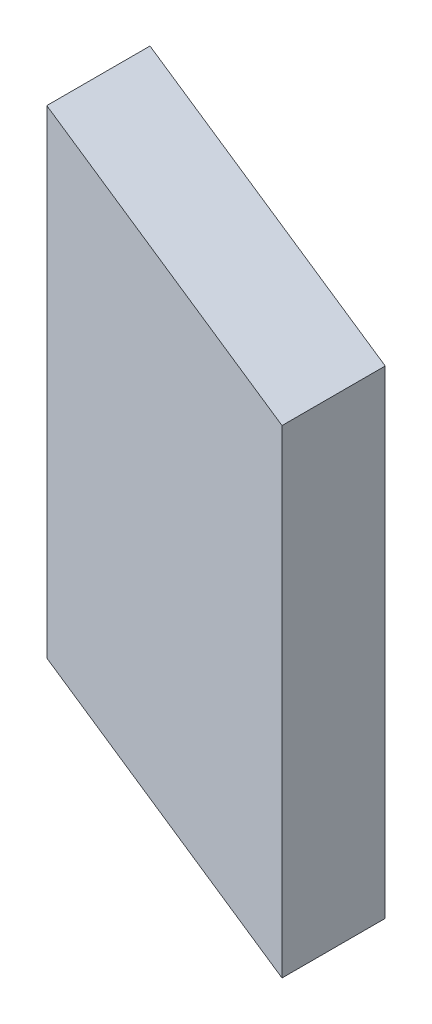
ISO-10303-21;
HEADER;
FILE_DESCRIPTION(('STEP AP214'),'2;1');
FILE_NAME('part.step','',(''),(''),'','','');
FILE_SCHEMA(('AUTOMOTIVE_DESIGN { 1 0 10303 214 1 1 1 1 }'));
ENDSEC;
DATA;
#1=APPLICATION_CONTEXT('core data for automotive mechanical design processes');
#2=APPLICATION_PROTOCOL_DEFINITION('international standard','automotive_design',2000,#1);
#3=PRODUCT_CONTEXT('',#1,'mechanical');
#4=PRODUCT('Part','Part','',(#3));
#5=PRODUCT_RELATED_PRODUCT_CATEGORY('part','',(#4));
#6=PRODUCT_DEFINITION_FORMATION('','',#4);
#7=PRODUCT_DEFINITION_CONTEXT('part definition',#1,'design');
#8=PRODUCT_DEFINITION('design','',#6,#7);
#9=PRODUCT_DEFINITION_SHAPE('','',#8);
#10=(LENGTH_UNIT() NAMED_UNIT(*) SI_UNIT(.MILLI.,.METRE.));
#11=(NAMED_UNIT(*) PLANE_ANGLE_UNIT() SI_UNIT($,.RADIAN.));
#12=(NAMED_UNIT(*) SI_UNIT($,.STERADIAN.) SOLID_ANGLE_UNIT());
#13=UNCERTAINTY_MEASURE_WITH_UNIT(LENGTH_MEASURE(1.E-05),#10,'distance_accuracy_value','');
#14=(GEOMETRIC_REPRESENTATION_CONTEXT(3) GLOBAL_UNCERTAINTY_ASSIGNED_CONTEXT((#13)) GLOBAL_UNIT_ASSIGNED_CONTEXT((#10,
#11,#12)) REPRESENTATION_CONTEXT('',''));
#15=CARTESIAN_POINT('',(0.,0.,0.));
#16=DIRECTION('',(0.,0.,1.));
#17=DIRECTION('',(1.,0.,0.));
#18=AXIS2_PLACEMENT_3D('',#15,#16,#17);
#19=CARTESIAN_POINT('',(0.,40.,-35.));
#20=DIRECTION('',(-0.374606593415916,0.,0.927183854566786));
#21=DIRECTION('',(0.927183854566786,0.,0.374606593415916));
#22=AXIS2_PLACEMENT_3D('',#19,#20,#21);
#23=PLANE('',#22);
#24=DIRECTION('',(-0.927183854566786,0.,-0.374606593415916));
#25=VECTOR('',#24,1.);
#26=CARTESIAN_POINT('',(0.,0.,-35.));
#27=LINE('',#26,#25);
#28=CARTESIAN_POINT('',(33.,0.,-21.6671345474397));
#29=VERTEX_POINT('',#28);
#30=CARTESIAN_POINT('',(0.,0.,-35.));
#31=VERTEX_POINT('',#30);
#32=EDGE_CURVE('E95',#29,#31,#27,.T.);
#33=ORIENTED_EDGE('',*,*,#32,.T.);
#34=DIRECTION('',(0.,-1.,0.));
#35=VECTOR('',#34,1.);
#36=CARTESIAN_POINT('',(0.,40.,-35.));
#37=LINE('',#36,#35);
#38=CARTESIAN_POINT('',(0.,40.,-35.));
#39=VERTEX_POINT('',#38);
#40=EDGE_CURVE('E11',#39,#31,#37,.T.);
#41=ORIENTED_EDGE('',*,*,#40,.F.);
#42=DIRECTION('',(-0.927183854566786,0.,-0.374606593415916));
#43=VECTOR('',#42,1.);
#44=CARTESIAN_POINT('',(0.,40.,-35.));
#45=LINE('',#44,#43);
#46=CARTESIAN_POINT('',(33.,40.,-21.6671345474397));
#47=VERTEX_POINT('',#46);
#48=EDGE_CURVE('E83',#47,#39,#45,.T.);
#49=ORIENTED_EDGE('',*,*,#48,.F.);
#50=DIRECTION('',(0.,-1.,0.));
#51=VECTOR('',#50,1.);
#52=CARTESIAN_POINT('',(33.,40.,-21.6671345474397));
#53=LINE('',#52,#51);
#54=EDGE_CURVE('E91',#47,#29,#53,.T.);
#55=ORIENTED_EDGE('',*,*,#54,.T.);
#56=EDGE_LOOP('',(#33,#41,#49,#55));
#57=FACE_BOUND('',#56,.T.);
#58=ADVANCED_FACE('F32',(#57),#23,.F.);
#59=CARTESIAN_POINT('',(0.,40.,-26.3717220585793));
#60=DIRECTION('',(1.,0.,0.));
#61=DIRECTION('',(0.,0.,-1.));
#62=AXIS2_PLACEMENT_3D('',#59,#60,#61);
#63=PLANE('',#62);
#64=DIRECTION('',(0.,0.,1.));
#65=VECTOR('',#64,1.);
#66=CARTESIAN_POINT('',(0.,0.,-26.3717220585793));
#67=LINE('',#66,#65);
#68=CARTESIAN_POINT('',(0.,0.,-26.3717220585793));
#69=VERTEX_POINT('',#68);
#70=EDGE_CURVE('E87',#31,#69,#67,.T.);
#71=ORIENTED_EDGE('',*,*,#70,.T.);
#72=DIRECTION('',(0.,-1.,0.));
#73=VECTOR('',#72,1.);
#74=CARTESIAN_POINT('',(0.,40.,-26.3717220585793));
#75=LINE('',#74,#73);
#76=CARTESIAN_POINT('',(0.,40.,-26.3717220585793));
#77=VERTEX_POINT('',#76);
#78=EDGE_CURVE('E40',#77,#69,#75,.T.);
#79=ORIENTED_EDGE('',*,*,#78,.F.);
#80=DIRECTION('',(0.,0.,1.));
#81=VECTOR('',#80,1.);
#82=CARTESIAN_POINT('',(0.,40.,-26.3717220585793));
#83=LINE('',#82,#81);
#84=EDGE_CURVE('E78',#39,#77,#83,.T.);
#85=ORIENTED_EDGE('',*,*,#84,.F.);
#86=ORIENTED_EDGE('',*,*,#40,.T.);
#87=EDGE_LOOP('',(#71,#79,#85,#86));
#88=FACE_BOUND('',#87,.T.);
#89=ADVANCED_FACE('F86',(#88),#63,.F.);
#90=CARTESIAN_POINT('',(0.,40.,-26.3717220585793));
#91=DIRECTION('',(0.374606593415916,0.,-0.927183854566786));
#92=DIRECTION('',(-0.927183854566786,0.,-0.374606593415916));
#93=AXIS2_PLACEMENT_3D('',#90,#91,#92);
#94=PLANE('',#93);
#95=DIRECTION('',(0.927183854566786,0.,0.374606593415916));
#96=VECTOR('',#95,1.);
#97=CARTESIAN_POINT('',(0.,0.,-26.3717220585793));
#98=LINE('',#97,#96);
#99=CARTESIAN_POINT('',(33.,0.,-13.038856606019));
#100=VERTEX_POINT('',#99);
#101=EDGE_CURVE('E65',#69,#100,#98,.T.);
#102=ORIENTED_EDGE('',*,*,#101,.T.);
#103=DIRECTION('',(0.,-1.,0.));
#104=VECTOR('',#103,1.);
#105=CARTESIAN_POINT('',(33.,40.,-13.038856606019));
#106=LINE('',#105,#104);
#107=CARTESIAN_POINT('',(33.,40.,-13.038856606019));
#108=VERTEX_POINT('',#107);
#109=EDGE_CURVE('E88',#108,#100,#106,.T.);
#110=ORIENTED_EDGE('',*,*,#109,.F.);
#111=DIRECTION('',(0.927183854566786,0.,0.374606593415916));
#112=VECTOR('',#111,1.);
#113=CARTESIAN_POINT('',(0.,40.,-26.3717220585793));
#114=LINE('',#113,#112);
#115=EDGE_CURVE('E81',#77,#108,#114,.T.);
#116=ORIENTED_EDGE('',*,*,#115,.F.);
#117=ORIENTED_EDGE('',*,*,#78,.T.);
#118=EDGE_LOOP('',(#102,#110,#116,#117));
#119=FACE_BOUND('',#118,.T.);
#120=ADVANCED_FACE('F89',(#119),#94,.F.);
#121=CARTESIAN_POINT('',(33.,40.,-21.6671345474397));
#122=DIRECTION('',(-1.,0.,0.));
#123=DIRECTION('',(0.,0.,1.));
#124=AXIS2_PLACEMENT_3D('',#121,#122,#123);
#125=PLANE('',#124);
#126=DIRECTION('',(0.,0.,-1.));
#127=VECTOR('',#126,1.);
#128=CARTESIAN_POINT('',(33.,0.,-21.6671345474397));
#129=LINE('',#128,#127);
#130=EDGE_CURVE('E71',#100,#29,#129,.T.);
#131=ORIENTED_EDGE('',*,*,#130,.T.);
#132=ORIENTED_EDGE('',*,*,#54,.F.);
#133=DIRECTION('',(0.,0.,-1.));
#134=VECTOR('',#133,1.);
#135=CARTESIAN_POINT('',(33.,40.,-21.6671345474397));
#136=LINE('',#135,#134);
#137=EDGE_CURVE('E48',#108,#47,#136,.T.);
#138=ORIENTED_EDGE('',*,*,#137,.F.);
#139=ORIENTED_EDGE('',*,*,#109,.T.);
#140=EDGE_LOOP('',(#131,#132,#138,#139));
#141=FACE_BOUND('',#140,.T.);
#142=ADVANCED_FACE('F102',(#141),#125,.F.);
#143=CARTESIAN_POINT('',(0.,40.,0.));
#144=DIRECTION('',(0.,-1.,0.));
#145=DIRECTION('',(0.,0.,-1.));
#146=AXIS2_PLACEMENT_3D('',#143,#144,#145);
#147=PLANE('',#146);
#148=ORIENTED_EDGE('',*,*,#48,.T.);
#149=ORIENTED_EDGE('',*,*,#84,.T.);
#150=ORIENTED_EDGE('',*,*,#115,.T.);
#151=ORIENTED_EDGE('',*,*,#137,.T.);
#152=EDGE_LOOP('',(#148,#149,#150,#151));
#153=FACE_BOUND('',#152,.T.);
#154=ADVANCED_FACE('F79',(#153),#147,.F.);
#155=CARTESIAN_POINT('',(0.,0.,0.));
#156=DIRECTION('',(0.,-1.,0.));
#157=DIRECTION('',(0.,0.,-1.));
#158=AXIS2_PLACEMENT_3D('',#155,#156,#157);
#159=PLANE('',#158);
#160=ORIENTED_EDGE('',*,*,#32,.F.);
#161=ORIENTED_EDGE('',*,*,#130,.F.);
#162=ORIENTED_EDGE('',*,*,#101,.F.);
#163=ORIENTED_EDGE('',*,*,#70,.F.);
#164=EDGE_LOOP('',(#160,#161,#162,#163));
#165=FACE_BOUND('',#164,.T.);
#166=ADVANCED_FACE('F105',(#165),#159,.T.);
#167=CLOSED_SHELL('',(#58,#89,#120,#142,#154,#166));
#168=MANIFOLD_SOLID_BREP('B2',#167);
#169=ADVANCED_BREP_SHAPE_REPRESENTATION('',(#18,#168),#14);
#170=SHAPE_DEFINITION_REPRESENTATION(#9,#169);
ENDSEC;
END-ISO-10303-21;
